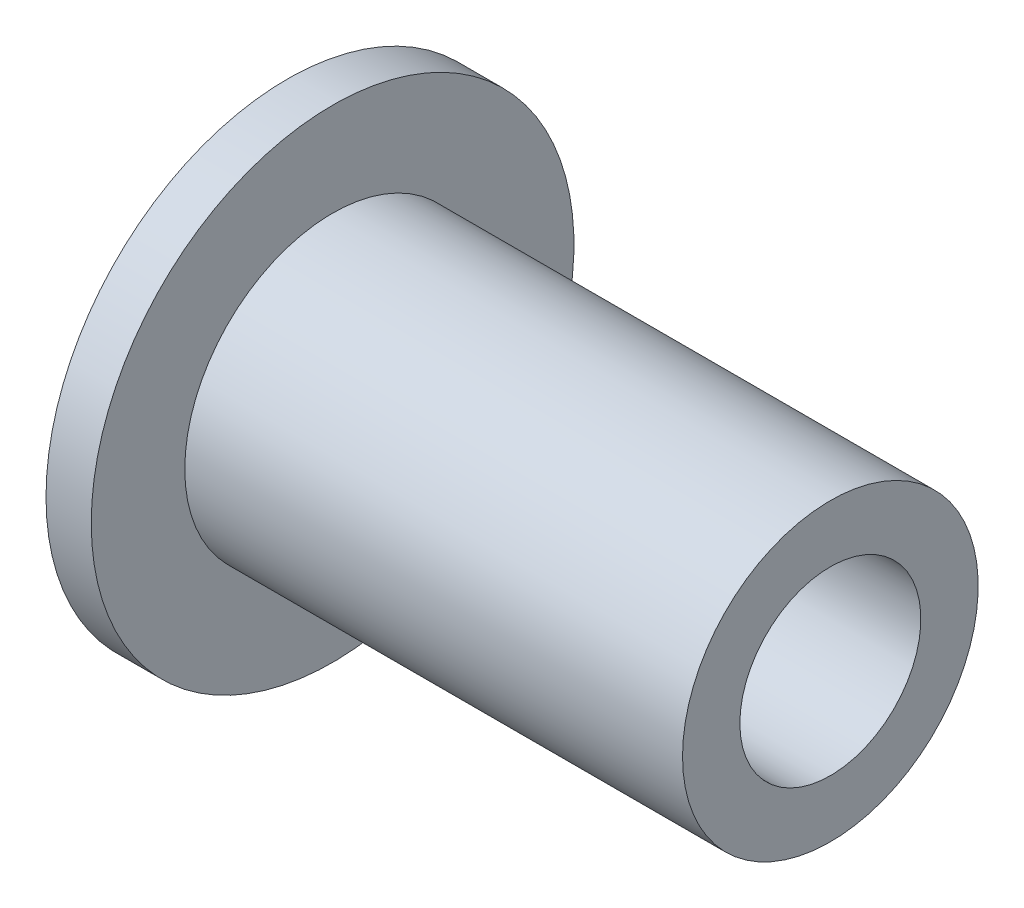
ISO-10303-21;
HEADER;
FILE_DESCRIPTION(('STEP AP214'),'2;1');
FILE_NAME('part.step','',(''),(''),'','','');
FILE_SCHEMA(('AUTOMOTIVE_DESIGN { 1 0 10303 214 1 1 1 1 }'));
ENDSEC;
DATA;
#1=APPLICATION_CONTEXT('core data for automotive mechanical design processes');
#2=APPLICATION_PROTOCOL_DEFINITION('international standard','automotive_design',2000,#1);
#3=PRODUCT_CONTEXT('',#1,'mechanical');
#4=PRODUCT('Part','Part','',(#3));
#5=PRODUCT_RELATED_PRODUCT_CATEGORY('part','',(#4));
#6=PRODUCT_DEFINITION_FORMATION('','',#4);
#7=PRODUCT_DEFINITION_CONTEXT('part definition',#1,'design');
#8=PRODUCT_DEFINITION('design','',#6,#7);
#9=PRODUCT_DEFINITION_SHAPE('','',#8);
#10=(LENGTH_UNIT() NAMED_UNIT(*) SI_UNIT(.MILLI.,.METRE.));
#11=(NAMED_UNIT(*) PLANE_ANGLE_UNIT() SI_UNIT($,.RADIAN.));
#12=(NAMED_UNIT(*) SI_UNIT($,.STERADIAN.) SOLID_ANGLE_UNIT());
#13=UNCERTAINTY_MEASURE_WITH_UNIT(LENGTH_MEASURE(1.E-05),#10,'distance_accuracy_value','');
#14=(GEOMETRIC_REPRESENTATION_CONTEXT(3) GLOBAL_UNCERTAINTY_ASSIGNED_CONTEXT((#13)) GLOBAL_UNIT_ASSIGNED_CONTEXT((#10,
#11,#12)) REPRESENTATION_CONTEXT('',''));
#15=CARTESIAN_POINT('',(0.,0.,0.));
#16=DIRECTION('',(0.,0.,1.));
#17=DIRECTION('',(1.,0.,0.));
#18=AXIS2_PLACEMENT_3D('',#15,#16,#17);
#19=CARTESIAN_POINT('',(0.,0.,0.));
#20=DIRECTION('',(-1.,0.,0.));
#21=DIRECTION('',(0.,0.,1.));
#22=AXIS2_PLACEMENT_3D('',#19,#20,#21);
#23=CYLINDRICAL_SURFACE('',#22,1.9);
#24=CARTESIAN_POINT('',(0.,0.,0.));
#25=DIRECTION('',(-1.,0.,0.));
#26=DIRECTION('',(0.,0.,1.));
#27=AXIS2_PLACEMENT_3D('',#24,#25,#26);
#28=CIRCLE('',#27,1.9);
#29=CARTESIAN_POINT('',(0.,0.,1.9));
#30=VERTEX_POINT('',#29);
#31=EDGE_CURVE('E10',#30,#30,#28,.T.);
#32=ORIENTED_EDGE('',*,*,#31,.T.);
#33=EDGE_LOOP('',(#32));
#34=FACE_BOUND('',#33,.T.);
#35=CARTESIAN_POINT('',(4.,0.,0.));
#36=DIRECTION('',(-1.,0.,0.));
#37=DIRECTION('',(0.,0.,1.));
#38=AXIS2_PLACEMENT_3D('',#35,#36,#37);
#39=CIRCLE('',#38,1.9);
#40=CARTESIAN_POINT('',(4.,0.,1.9));
#41=VERTEX_POINT('',#40);
#42=EDGE_CURVE('E63',#41,#41,#39,.T.);
#43=ORIENTED_EDGE('',*,*,#42,.F.);
#44=EDGE_LOOP('',(#43));
#45=FACE_BOUND('',#44,.T.);
#46=ADVANCED_FACE('F35',(#34,#45),#23,.F.);
#47=CARTESIAN_POINT('',(0.,1.9,0.));
#48=DIRECTION('',(-1.,0.,0.));
#49=DIRECTION('',(0.,0.,1.));
#50=AXIS2_PLACEMENT_3D('',#47,#48,#49);
#51=PLANE('',#50);
#52=CARTESIAN_POINT('',(0.,0.,0.));
#53=DIRECTION('',(-1.,0.,0.));
#54=DIRECTION('',(0.,0.,1.));
#55=AXIS2_PLACEMENT_3D('',#52,#53,#54);
#56=CIRCLE('',#55,4.);
#57=CARTESIAN_POINT('',(0.,0.,4.));
#58=VERTEX_POINT('',#57);
#59=EDGE_CURVE('E41',#58,#58,#56,.T.);
#60=ORIENTED_EDGE('',*,*,#59,.T.);
#61=EDGE_LOOP('',(#60));
#62=FACE_BOUND('',#61,.T.);
#63=ORIENTED_EDGE('',*,*,#31,.F.);
#64=EDGE_LOOP('',(#63));
#65=FACE_BOUND('',#64,.T.);
#66=ADVANCED_FACE('F71',(#62,#65),#51,.T.);
#67=CARTESIAN_POINT('',(0.,0.,0.));
#68=DIRECTION('',(-1.,0.,0.));
#69=DIRECTION('',(0.,0.,1.));
#70=AXIS2_PLACEMENT_3D('',#67,#68,#69);
#71=CYLINDRICAL_SURFACE('',#70,4.);
#72=CARTESIAN_POINT('',(0.75,0.,0.));
#73=DIRECTION('',(-1.,0.,0.));
#74=DIRECTION('',(0.,0.,1.));
#75=AXIS2_PLACEMENT_3D('',#72,#73,#74);
#76=CIRCLE('',#75,4.);
#77=CARTESIAN_POINT('',(0.75,0.,4.));
#78=VERTEX_POINT('',#77);
#79=EDGE_CURVE('E45',#78,#78,#76,.T.);
#80=ORIENTED_EDGE('',*,*,#79,.T.);
#81=EDGE_LOOP('',(#80));
#82=FACE_BOUND('',#81,.T.);
#83=ORIENTED_EDGE('',*,*,#59,.F.);
#84=EDGE_LOOP('',(#83));
#85=FACE_BOUND('',#84,.T.);
#86=ADVANCED_FACE('F75',(#82,#85),#71,.T.);
#87=CARTESIAN_POINT('',(0.75,4.,0.));
#88=DIRECTION('',(1.,0.,0.));
#89=DIRECTION('',(0.,0.,-1.));
#90=AXIS2_PLACEMENT_3D('',#87,#88,#89);
#91=PLANE('',#90);
#92=CARTESIAN_POINT('',(0.75,0.,0.));
#93=DIRECTION('',(-1.,0.,0.));
#94=DIRECTION('',(0.,0.,1.));
#95=AXIS2_PLACEMENT_3D('',#92,#93,#94);
#96=CIRCLE('',#95,2.45);
#97=CARTESIAN_POINT('',(0.75,0.,2.45));
#98=VERTEX_POINT('',#97);
#99=EDGE_CURVE('E49',#98,#98,#96,.T.);
#100=ORIENTED_EDGE('',*,*,#99,.T.);
#101=EDGE_LOOP('',(#100));
#102=FACE_BOUND('',#101,.T.);
#103=ORIENTED_EDGE('',*,*,#79,.F.);
#104=EDGE_LOOP('',(#103));
#105=FACE_BOUND('',#104,.T.);
#106=ADVANCED_FACE('F79',(#102,#105),#91,.T.);
#107=CARTESIAN_POINT('',(0.,0.,0.));
#108=DIRECTION('',(-1.,0.,0.));
#109=DIRECTION('',(0.,0.,1.));
#110=AXIS2_PLACEMENT_3D('',#107,#108,#109);
#111=CYLINDRICAL_SURFACE('',#110,2.45);
#112=CARTESIAN_POINT('',(9.,0.,0.));
#113=DIRECTION('',(-1.,0.,0.));
#114=DIRECTION('',(0.,0.,1.));
#115=AXIS2_PLACEMENT_3D('',#112,#113,#114);
#116=CIRCLE('',#115,2.45);
#117=CARTESIAN_POINT('',(9.,0.,2.45));
#118=VERTEX_POINT('',#117);
#119=EDGE_CURVE('E54',#118,#118,#116,.T.);
#120=ORIENTED_EDGE('',*,*,#119,.T.);
#121=EDGE_LOOP('',(#120));
#122=FACE_BOUND('',#121,.T.);
#123=ORIENTED_EDGE('',*,*,#99,.F.);
#124=EDGE_LOOP('',(#123));
#125=FACE_BOUND('',#124,.T.);
#126=ADVANCED_FACE('F86',(#122,#125),#111,.T.);
#127=CARTESIAN_POINT('',(9.,2.45,0.));
#128=DIRECTION('',(1.,0.,0.));
#129=DIRECTION('',(0.,0.,-1.));
#130=AXIS2_PLACEMENT_3D('',#127,#128,#129);
#131=PLANE('',#130);
#132=CARTESIAN_POINT('',(9.,0.,0.));
#133=DIRECTION('',(-1.,0.,0.));
#134=DIRECTION('',(0.,0.,1.));
#135=AXIS2_PLACEMENT_3D('',#132,#133,#134);
#136=CIRCLE('',#135,1.5);
#137=CARTESIAN_POINT('',(9.,0.,1.5));
#138=VERTEX_POINT('',#137);
#139=EDGE_CURVE('E57',#138,#138,#136,.T.);
#140=ORIENTED_EDGE('',*,*,#139,.T.);
#141=EDGE_LOOP('',(#140));
#142=FACE_BOUND('',#141,.T.);
#143=ORIENTED_EDGE('',*,*,#119,.F.);
#144=EDGE_LOOP('',(#143));
#145=FACE_BOUND('',#144,.T.);
#146=ADVANCED_FACE('F90',(#142,#145),#131,.T.);
#147=CARTESIAN_POINT('',(0.,0.,0.));
#148=DIRECTION('',(-1.,0.,0.));
#149=DIRECTION('',(0.,0.,1.));
#150=AXIS2_PLACEMENT_3D('',#147,#148,#149);
#151=CYLINDRICAL_SURFACE('',#150,1.5);
#152=CARTESIAN_POINT('',(4.,0.,0.));
#153=DIRECTION('',(-1.,0.,0.));
#154=DIRECTION('',(0.,0.,1.));
#155=AXIS2_PLACEMENT_3D('',#152,#153,#154);
#156=CIRCLE('',#155,1.5);
#157=CARTESIAN_POINT('',(4.,0.,1.5));
#158=VERTEX_POINT('',#157);
#159=EDGE_CURVE('E60',#158,#158,#156,.T.);
#160=ORIENTED_EDGE('',*,*,#159,.T.);
#161=EDGE_LOOP('',(#160));
#162=FACE_BOUND('',#161,.T.);
#163=ORIENTED_EDGE('',*,*,#139,.F.);
#164=EDGE_LOOP('',(#163));
#165=FACE_BOUND('',#164,.T.);
#166=ADVANCED_FACE('F94',(#162,#165),#151,.F.);
#167=CARTESIAN_POINT('',(4.,1.5,0.));
#168=DIRECTION('',(-1.,0.,0.));
#169=DIRECTION('',(0.,0.,1.));
#170=AXIS2_PLACEMENT_3D('',#167,#168,#169);
#171=PLANE('',#170);
#172=ORIENTED_EDGE('',*,*,#42,.T.);
#173=EDGE_LOOP('',(#172));
#174=FACE_BOUND('',#173,.T.);
#175=ORIENTED_EDGE('',*,*,#159,.F.);
#176=EDGE_LOOP('',(#175));
#177=FACE_BOUND('',#176,.T.);
#178=ADVANCED_FACE('F67',(#174,#177),#171,.T.);
#179=CLOSED_SHELL('',(#46,#66,#86,#106,#126,#146,#166,#178));
#180=MANIFOLD_SOLID_BREP('B2',#179);
#181=ADVANCED_BREP_SHAPE_REPRESENTATION('',(#18,#180),#14);
#182=SHAPE_DEFINITION_REPRESENTATION(#9,#181);
ENDSEC;
END-ISO-10303-21;
